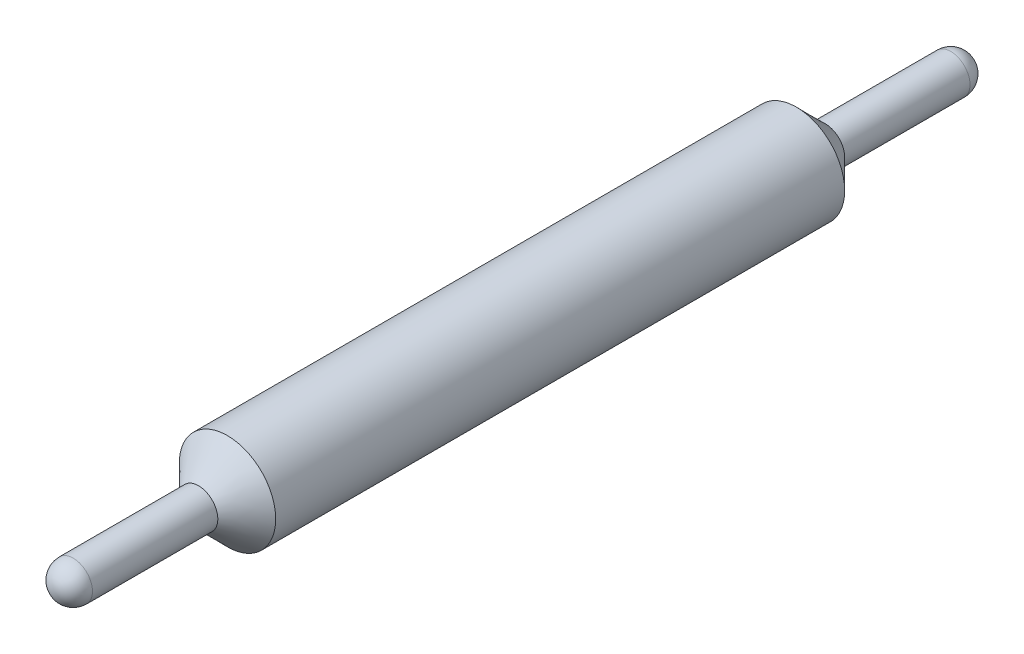
ISO-10303-21;
HEADER;
FILE_DESCRIPTION(('STEP AP214'),'2;1');
FILE_NAME('part.step','',(''),(''),'','','');
FILE_SCHEMA(('AUTOMOTIVE_DESIGN { 1 0 10303 214 1 1 1 1 }'));
ENDSEC;
DATA;
#1=APPLICATION_CONTEXT('core data for automotive mechanical design processes');
#2=APPLICATION_PROTOCOL_DEFINITION('international standard','automotive_design',2000,#1);
#3=PRODUCT_CONTEXT('',#1,'mechanical');
#4=PRODUCT('Part','Part','',(#3));
#5=PRODUCT_RELATED_PRODUCT_CATEGORY('part','',(#4));
#6=PRODUCT_DEFINITION_FORMATION('','',#4);
#7=PRODUCT_DEFINITION_CONTEXT('part definition',#1,'design');
#8=PRODUCT_DEFINITION('design','',#6,#7);
#9=PRODUCT_DEFINITION_SHAPE('','',#8);
#10=(LENGTH_UNIT() NAMED_UNIT(*) SI_UNIT(.MILLI.,.METRE.));
#11=(NAMED_UNIT(*) PLANE_ANGLE_UNIT() SI_UNIT($,.RADIAN.));
#12=(NAMED_UNIT(*) SI_UNIT($,.STERADIAN.) SOLID_ANGLE_UNIT());
#13=UNCERTAINTY_MEASURE_WITH_UNIT(LENGTH_MEASURE(1.E-05),#10,'distance_accuracy_value','');
#14=(GEOMETRIC_REPRESENTATION_CONTEXT(3) GLOBAL_UNCERTAINTY_ASSIGNED_CONTEXT((#13)) GLOBAL_UNIT_ASSIGNED_CONTEXT((#10,
#11,#12)) REPRESENTATION_CONTEXT('',''));
#15=CARTESIAN_POINT('',(0.,0.,0.));
#16=DIRECTION('',(0.,0.,1.));
#17=DIRECTION('',(1.,0.,0.));
#18=AXIS2_PLACEMENT_3D('',#15,#16,#17);
#19=CARTESIAN_POINT('',(0.,0.,3.25));
#20=DIRECTION('',(0.,0.,-1.));
#21=DIRECTION('',(-1.,0.,0.));
#22=AXIS2_PLACEMENT_3D('',#19,#20,#21);
#23=CYLINDRICAL_SURFACE('',#22,0.25);
#24=CARTESIAN_POINT('',(0.,0.,3.1));
#25=DIRECTION('',(0.,0.,1.));
#26=DIRECTION('',(1.,0.,0.));
#27=AXIS2_PLACEMENT_3D('',#24,#25,#26);
#28=CIRCLE('',#27,0.25);
#29=CARTESIAN_POINT('',(0.25,0.,3.1));
#30=VERTEX_POINT('',#29);
#31=EDGE_CURVE('E10',#30,#30,#28,.F.);
#32=ORIENTED_EDGE('',*,*,#31,.T.);
#33=EDGE_LOOP('',(#32));
#34=FACE_BOUND('',#33,.T.);
#35=CARTESIAN_POINT('',(0.,0.,0.150000000000002));
#36=DIRECTION('',(0.,0.,1.));
#37=DIRECTION('',(1.,0.,0.));
#38=AXIS2_PLACEMENT_3D('',#35,#36,#37);
#39=CIRCLE('',#38,0.25);
#40=CARTESIAN_POINT('',(0.25,0.,0.150000000000002));
#41=VERTEX_POINT('',#40);
#42=EDGE_CURVE('E46',#41,#41,#39,.T.);
#43=ORIENTED_EDGE('',*,*,#42,.T.);
#44=EDGE_LOOP('',(#43));
#45=FACE_BOUND('',#44,.T.);
#46=ADVANCED_FACE('F39',(#34,#45),#23,.T.);
#47=CARTESIAN_POINT('',(0.,0.,-0.65));
#48=DIRECTION('',(0.,0.,1.));
#49=DIRECTION('',(1.,0.,0.));
#50=AXIS2_PLACEMENT_3D('',#47,#48,#49);
#51=CYLINDRICAL_SURFACE('',#50,0.1);
#52=CARTESIAN_POINT('',(0.,0.,-0.65));
#53=DIRECTION('',(0.,0.,-1.));
#54=DIRECTION('',(-1.,0.,0.));
#55=AXIS2_PLACEMENT_3D('',#52,#53,#54);
#56=CIRCLE('',#55,0.1);
#57=CARTESIAN_POINT('',(-0.1,0.,-0.65));
#58=VERTEX_POINT('',#57);
#59=EDGE_CURVE('E54',#58,#58,#56,.T.);
#60=ORIENTED_EDGE('',*,*,#59,.F.);
#61=EDGE_LOOP('',(#60));
#62=FACE_BOUND('',#61,.T.);
#63=CARTESIAN_POINT('',(0.,0.,0.));
#64=DIRECTION('',(0.,0.,1.));
#65=DIRECTION('',(1.,0.,0.));
#66=AXIS2_PLACEMENT_3D('',#63,#64,#65);
#67=CIRCLE('',#66,0.1);
#68=CARTESIAN_POINT('',(0.1,0.,0.));
#69=VERTEX_POINT('',#68);
#70=EDGE_CURVE('E50',#69,#69,#67,.F.);
#71=ORIENTED_EDGE('',*,*,#70,.T.);
#72=EDGE_LOOP('',(#71));
#73=FACE_BOUND('',#72,.T.);
#74=ADVANCED_FACE('F80',(#62,#73),#51,.T.);
#75=CARTESIAN_POINT('',(0.,0.,-0.65));
#76=DIRECTION('',(0.,0.,1.));
#77=DIRECTION('',(1.,0.,0.));
#78=AXIS2_PLACEMENT_3D('',#75,#76,#77);
#79=SPHERICAL_SURFACE('',#78,0.1);
#80=ORIENTED_EDGE('',*,*,#59,.T.);
#81=EDGE_LOOP('',(#80));
#82=FACE_BOUND('',#81,.T.);
#83=ADVANCED_FACE('F85',(#82),#79,.T.);
#84=CARTESIAN_POINT('',(0.,0.,3.9));
#85=DIRECTION('',(0.,0.,-1.));
#86=DIRECTION('',(-1.,0.,0.));
#87=AXIS2_PLACEMENT_3D('',#84,#85,#86);
#88=CYLINDRICAL_SURFACE('',#87,0.1);
#89=CARTESIAN_POINT('',(0.,0.,3.9));
#90=DIRECTION('',(0.,0.,1.));
#91=DIRECTION('',(1.,0.,0.));
#92=AXIS2_PLACEMENT_3D('',#89,#90,#91);
#93=CIRCLE('',#92,0.1);
#94=CARTESIAN_POINT('',(0.1,0.,3.9));
#95=VERTEX_POINT('',#94);
#96=EDGE_CURVE('E57',#95,#95,#93,.T.);
#97=ORIENTED_EDGE('',*,*,#96,.F.);
#98=EDGE_LOOP('',(#97));
#99=FACE_BOUND('',#98,.T.);
#100=CARTESIAN_POINT('',(0.,0.,3.25));
#101=DIRECTION('',(0.,0.,1.));
#102=DIRECTION('',(1.,0.,0.));
#103=AXIS2_PLACEMENT_3D('',#100,#101,#102);
#104=CIRCLE('',#103,0.1);
#105=CARTESIAN_POINT('',(0.1,0.,3.25));
#106=VERTEX_POINT('',#105);
#107=EDGE_CURVE('E60',#106,#106,#104,.T.);
#108=ORIENTED_EDGE('',*,*,#107,.T.);
#109=EDGE_LOOP('',(#108));
#110=FACE_BOUND('',#109,.T.);
#111=ADVANCED_FACE('F66',(#99,#110),#88,.T.);
#112=CARTESIAN_POINT('',(0.,0.,3.9));
#113=DIRECTION('',(0.,0.,1.));
#114=DIRECTION('',(1.,0.,0.));
#115=AXIS2_PLACEMENT_3D('',#112,#113,#114);
#116=SPHERICAL_SURFACE('',#115,0.1);
#117=ORIENTED_EDGE('',*,*,#96,.T.);
#118=EDGE_LOOP('',(#117));
#119=FACE_BOUND('',#118,.T.);
#120=ADVANCED_FACE('F70',(#119),#116,.T.);
#121=CARTESIAN_POINT('',(0.,0.,3.25));
#122=DIRECTION('',(0.,0.,-1.));
#123=DIRECTION('',(-1.,0.,0.));
#124=AXIS2_PLACEMENT_3D('',#121,#122,#123);
#125=CONICAL_SURFACE('',#124,0.100000000000002,0.785398163397447);
#126=ORIENTED_EDGE('',*,*,#31,.F.);
#127=EDGE_LOOP('',(#126));
#128=FACE_BOUND('',#127,.T.);
#129=ORIENTED_EDGE('',*,*,#107,.F.);
#130=EDGE_LOOP('',(#129));
#131=FACE_BOUND('',#130,.T.);
#132=ADVANCED_FACE('F68',(#128,#131),#125,.T.);
#133=CARTESIAN_POINT('',(0.,0.,0.150000000000002));
#134=DIRECTION('',(0.,0.,1.));
#135=DIRECTION('',(1.,0.,0.));
#136=AXIS2_PLACEMENT_3D('',#133,#134,#135);
#137=CONICAL_SURFACE('',#136,0.25,0.785398163397453);
#138=ORIENTED_EDGE('',*,*,#70,.F.);
#139=EDGE_LOOP('',(#138));
#140=FACE_BOUND('',#139,.T.);
#141=ORIENTED_EDGE('',*,*,#42,.F.);
#142=EDGE_LOOP('',(#141));
#143=FACE_BOUND('',#142,.T.);
#144=ADVANCED_FACE('F41',(#140,#143),#137,.T.);
#145=CLOSED_SHELL('',(#46,#74,#83,#111,#120,#132,#144));
#146=MANIFOLD_SOLID_BREP('B2',#145);
#147=ADVANCED_BREP_SHAPE_REPRESENTATION('',(#18,#146),#14);
#148=SHAPE_DEFINITION_REPRESENTATION(#9,#147);
ENDSEC;
END-ISO-10303-21;
